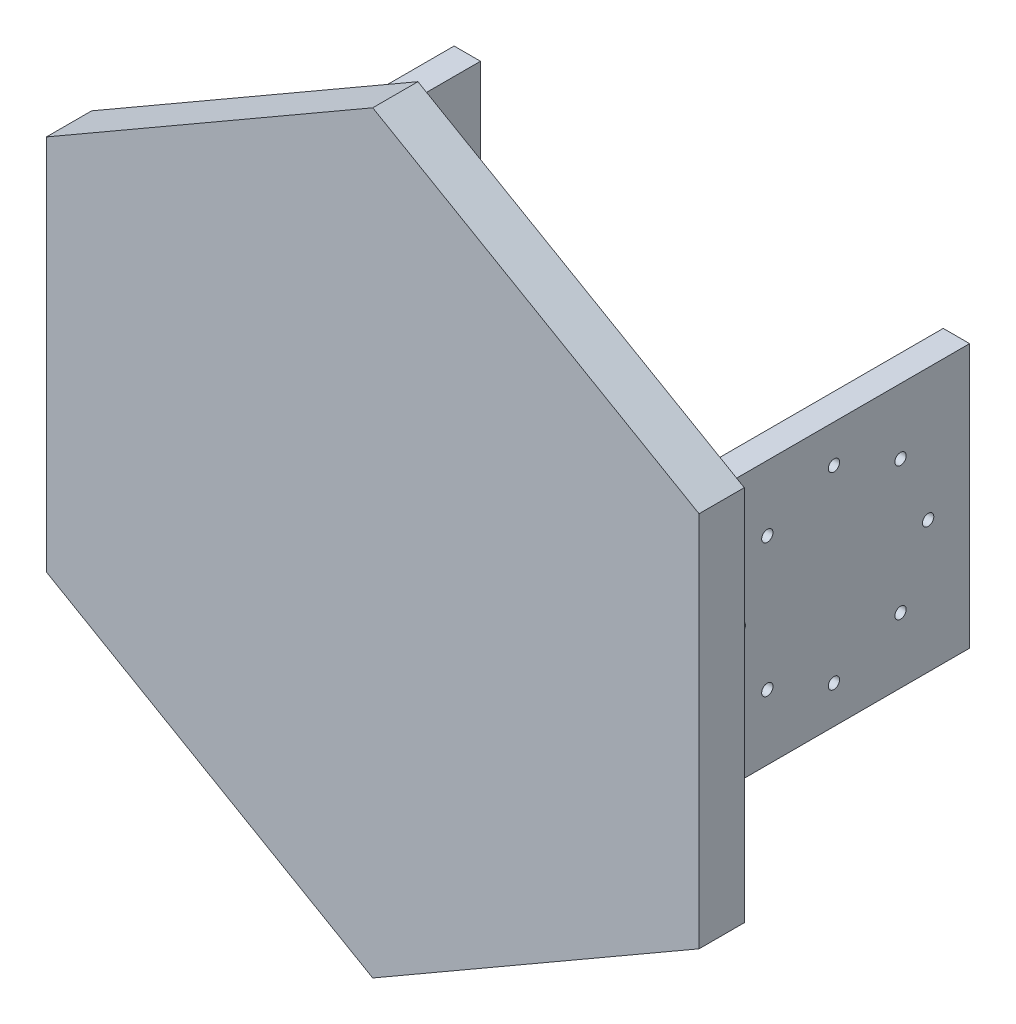
ISO-10303-21;
HEADER;
FILE_DESCRIPTION(('STEP AP214'),'2;1');
FILE_NAME('part.step','',(''),(''),'','','');
FILE_SCHEMA(('AUTOMOTIVE_DESIGN { 1 0 10303 214 1 1 1 1 }'));
ENDSEC;
DATA;
#1=APPLICATION_CONTEXT('core data for automotive mechanical design processes');
#2=APPLICATION_PROTOCOL_DEFINITION('international standard','automotive_design',2000,#1);
#3=PRODUCT_CONTEXT('',#1,'mechanical');
#4=PRODUCT('Part','Part','',(#3));
#5=PRODUCT_RELATED_PRODUCT_CATEGORY('part','',(#4));
#6=PRODUCT_DEFINITION_FORMATION('','',#4);
#7=PRODUCT_DEFINITION_CONTEXT('part definition',#1,'design');
#8=PRODUCT_DEFINITION('design','',#6,#7);
#9=PRODUCT_DEFINITION_SHAPE('','',#8);
#10=(LENGTH_UNIT() NAMED_UNIT(*) SI_UNIT(.MILLI.,.METRE.));
#11=(NAMED_UNIT(*) PLANE_ANGLE_UNIT() SI_UNIT($,.RADIAN.));
#12=(NAMED_UNIT(*) SI_UNIT($,.STERADIAN.) SOLID_ANGLE_UNIT());
#13=UNCERTAINTY_MEASURE_WITH_UNIT(LENGTH_MEASURE(1.E-05),#10,'distance_accuracy_value','');
#14=(GEOMETRIC_REPRESENTATION_CONTEXT(3) GLOBAL_UNCERTAINTY_ASSIGNED_CONTEXT((#13)) GLOBAL_UNIT_ASSIGNED_CONTEXT((#10,
#11,#12)) REPRESENTATION_CONTEXT('',''));
#15=CARTESIAN_POINT('',(0.,0.,0.));
#16=DIRECTION('',(0.,0.,1.));
#17=DIRECTION('',(1.,0.,0.));
#18=AXIS2_PLACEMENT_3D('',#15,#16,#17);
#19=CARTESIAN_POINT('',(25.7,17.5,-10.));
#20=DIRECTION('',(0.,1.,0.));
#21=DIRECTION('',(0.,0.,1.));
#22=AXIS2_PLACEMENT_3D('',#19,#20,#21);
#23=PLANE('',#22);
#24=DIRECTION('',(0.,0.,1.));
#25=VECTOR('',#24,1.);
#26=CARTESIAN_POINT('',(-34.2,17.5,-45.));
#27=LINE('',#26,#25);
#28=CARTESIAN_POINT('',(-34.2,17.5,-45.));
#29=VERTEX_POINT('',#28);
#30=CARTESIAN_POINT('',(-34.2,17.5,-6.));
#31=VERTEX_POINT('',#30);
#32=EDGE_CURVE('E341',#29,#31,#27,.T.);
#33=ORIENTED_EDGE('',*,*,#32,.T.);
#34=DIRECTION('',(1.,0.,0.));
#35=VECTOR('',#34,1.);
#36=CARTESIAN_POINT('',(25.7,17.5,-6.));
#37=LINE('',#36,#35);
#38=CARTESIAN_POINT('',(-28.7,17.5,-6.));
#39=VERTEX_POINT('',#38);
#40=EDGE_CURVE('E221',#31,#39,#37,.T.);
#41=ORIENTED_EDGE('',*,*,#40,.T.);
#42=CARTESIAN_POINT('',(-25.7,17.5,-10.));
#43=DIRECTION('',(0.,-1.,0.));
#44=DIRECTION('',(0.,0.,1.));
#45=AXIS2_PLACEMENT_3D('',#42,#43,#44);
#46=CIRCLE('',#45,5.);
#47=CARTESIAN_POINT('',(-30.7,17.5,-10.));
#48=VERTEX_POINT('',#47);
#49=EDGE_CURVE('E335',#39,#48,#46,.T.);
#50=ORIENTED_EDGE('',*,*,#49,.T.);
#51=DIRECTION('',(0.,0.,-1.));
#52=VECTOR('',#51,1.);
#53=CARTESIAN_POINT('',(-30.7,17.5,-45.));
#54=LINE('',#53,#52);
#55=CARTESIAN_POINT('',(-30.7,17.5,-45.));
#56=VERTEX_POINT('',#55);
#57=EDGE_CURVE('E337',#48,#56,#54,.T.);
#58=ORIENTED_EDGE('',*,*,#57,.T.);
#59=DIRECTION('',(-1.,0.,0.));
#60=VECTOR('',#59,1.);
#61=CARTESIAN_POINT('',(-30.7,17.5,-45.));
#62=LINE('',#61,#60);
#63=EDGE_CURVE('E339',#56,#29,#62,.T.);
#64=ORIENTED_EDGE('',*,*,#63,.T.);
#65=EDGE_LOOP('',(#33,#41,#50,#58,#64));
#66=FACE_BOUND('',#65,.T.);
#67=ADVANCED_FACE('F42',(#66),#23,.T.);
#68=CARTESIAN_POINT('',(25.7,17.5,-10.));
#69=DIRECTION('',(0.,-1.,0.));
#70=DIRECTION('',(0.,0.,1.));
#71=AXIS2_PLACEMENT_3D('',#68,#69,#70);
#72=CIRCLE('',#71,5.);
#73=CARTESIAN_POINT('',(30.7,17.5,-10.));
#74=VERTEX_POINT('',#73);
#75=CARTESIAN_POINT('',(28.7,17.5,-6.));
#76=VERTEX_POINT('',#75);
#77=EDGE_CURVE('E332',#74,#76,#72,.T.);
#78=ORIENTED_EDGE('',*,*,#77,.T.);
#79=CARTESIAN_POINT('',(34.2,17.5,-6.));
#80=VERTEX_POINT('',#79);
#81=EDGE_CURVE('E220',#76,#80,#37,.T.);
#82=ORIENTED_EDGE('',*,*,#81,.T.);
#83=DIRECTION('',(0.,0.,-1.));
#84=VECTOR('',#83,1.);
#85=CARTESIAN_POINT('',(34.2,17.5,-5.));
#86=LINE('',#85,#84);
#87=CARTESIAN_POINT('',(34.2,17.5,-45.));
#88=VERTEX_POINT('',#87);
#89=EDGE_CURVE('E344',#80,#88,#86,.T.);
#90=ORIENTED_EDGE('',*,*,#89,.T.);
#91=DIRECTION('',(-1.,0.,0.));
#92=VECTOR('',#91,1.);
#93=CARTESIAN_POINT('',(34.2,17.5,-45.));
#94=LINE('',#93,#92);
#95=CARTESIAN_POINT('',(30.7,17.5,-45.));
#96=VERTEX_POINT('',#95);
#97=EDGE_CURVE('E326',#88,#96,#94,.T.);
#98=ORIENTED_EDGE('',*,*,#97,.T.);
#99=DIRECTION('',(0.,0.,1.));
#100=VECTOR('',#99,1.);
#101=CARTESIAN_POINT('',(30.7,17.5,-10.));
#102=LINE('',#101,#100);
#103=EDGE_CURVE('E329',#96,#74,#102,.T.);
#104=ORIENTED_EDGE('',*,*,#103,.T.);
#105=EDGE_LOOP('',(#78,#82,#90,#98,#104));
#106=FACE_BOUND('',#105,.T.);
#107=ADVANCED_FACE('F388',(#106),#23,.T.);
#108=CARTESIAN_POINT('',(25.7,-17.5,-10.));
#109=DIRECTION('',(0.,1.,0.));
#110=DIRECTION('',(0.,0.,1.));
#111=AXIS2_PLACEMENT_3D('',#108,#109,#110);
#112=PLANE('',#111);
#113=DIRECTION('',(1.,0.,0.));
#114=VECTOR('',#113,1.);
#115=CARTESIAN_POINT('',(25.7,-17.5,-6.));
#116=LINE('',#115,#114);
#117=CARTESIAN_POINT('',(-34.2,-17.5,-6.));
#118=VERTEX_POINT('',#117);
#119=CARTESIAN_POINT('',(-28.7,-17.5,-6.));
#120=VERTEX_POINT('',#119);
#121=EDGE_CURVE('E209',#118,#120,#116,.T.);
#122=ORIENTED_EDGE('',*,*,#121,.F.);
#123=DIRECTION('',(0.,0.,1.));
#124=VECTOR('',#123,1.);
#125=CARTESIAN_POINT('',(-34.2,-17.5,-45.));
#126=LINE('',#125,#124);
#127=CARTESIAN_POINT('',(-34.2,-17.5,-45.));
#128=VERTEX_POINT('',#127);
#129=EDGE_CURVE('E360',#128,#118,#126,.T.);
#130=ORIENTED_EDGE('',*,*,#129,.F.);
#131=DIRECTION('',(-1.,0.,0.));
#132=VECTOR('',#131,1.);
#133=CARTESIAN_POINT('',(-30.7,-17.5,-45.));
#134=LINE('',#133,#132);
#135=CARTESIAN_POINT('',(-30.7,-17.5,-45.));
#136=VERTEX_POINT('',#135);
#137=EDGE_CURVE('E358',#136,#128,#134,.T.);
#138=ORIENTED_EDGE('',*,*,#137,.F.);
#139=DIRECTION('',(0.,0.,-1.));
#140=VECTOR('',#139,1.);
#141=CARTESIAN_POINT('',(-30.7,-17.5,-45.));
#142=LINE('',#141,#140);
#143=CARTESIAN_POINT('',(-30.7,-17.5,-10.));
#144=VERTEX_POINT('',#143);
#145=EDGE_CURVE('E356',#144,#136,#142,.T.);
#146=ORIENTED_EDGE('',*,*,#145,.F.);
#147=CARTESIAN_POINT('',(-25.7,-17.5,-10.));
#148=DIRECTION('',(0.,-1.,0.));
#149=DIRECTION('',(0.,0.,1.));
#150=AXIS2_PLACEMENT_3D('',#147,#148,#149);
#151=CIRCLE('',#150,5.);
#152=EDGE_CURVE('E354',#120,#144,#151,.T.);
#153=ORIENTED_EDGE('',*,*,#152,.F.);
#154=EDGE_LOOP('',(#122,#130,#138,#146,#153));
#155=FACE_BOUND('',#154,.T.);
#156=ADVANCED_FACE('F419',(#155),#112,.F.);
#157=CARTESIAN_POINT('',(28.7,-17.5,-6.));
#158=VERTEX_POINT('',#157);
#159=CARTESIAN_POINT('',(34.2,-17.5,-6.));
#160=VERTEX_POINT('',#159);
#161=EDGE_CURVE('E217',#158,#160,#116,.T.);
#162=ORIENTED_EDGE('',*,*,#161,.F.);
#163=CARTESIAN_POINT('',(25.7,-17.5,-10.));
#164=DIRECTION('',(0.,-1.,0.));
#165=DIRECTION('',(0.,0.,1.));
#166=AXIS2_PLACEMENT_3D('',#163,#164,#165);
#167=CIRCLE('',#166,5.);
#168=CARTESIAN_POINT('',(30.7,-17.5,-10.));
#169=VERTEX_POINT('',#168);
#170=EDGE_CURVE('E351',#169,#158,#167,.T.);
#171=ORIENTED_EDGE('',*,*,#170,.F.);
#172=DIRECTION('',(0.,0.,1.));
#173=VECTOR('',#172,1.);
#174=CARTESIAN_POINT('',(30.7,-17.5,-10.));
#175=LINE('',#174,#173);
#176=CARTESIAN_POINT('',(30.7,-17.5,-45.));
#177=VERTEX_POINT('',#176);
#178=EDGE_CURVE('E349',#177,#169,#175,.T.);
#179=ORIENTED_EDGE('',*,*,#178,.F.);
#180=DIRECTION('',(-1.,0.,0.));
#181=VECTOR('',#180,1.);
#182=CARTESIAN_POINT('',(34.2,-17.5,-45.));
#183=LINE('',#182,#181);
#184=CARTESIAN_POINT('',(34.2,-17.5,-45.));
#185=VERTEX_POINT('',#184);
#186=EDGE_CURVE('E325',#185,#177,#183,.T.);
#187=ORIENTED_EDGE('',*,*,#186,.F.);
#188=DIRECTION('',(0.,0.,-1.));
#189=VECTOR('',#188,1.);
#190=CARTESIAN_POINT('',(34.2,-17.5,-5.));
#191=LINE('',#190,#189);
#192=EDGE_CURVE('E330',#160,#185,#191,.T.);
#193=ORIENTED_EDGE('',*,*,#192,.F.);
#194=EDGE_LOOP('',(#162,#171,#179,#187,#193));
#195=FACE_BOUND('',#194,.T.);
#196=ADVANCED_FACE('F382',(#195),#112,.F.);
#197=CARTESIAN_POINT('',(34.2,17.5,-45.));
#198=DIRECTION('',(0.,0.,1.));
#199=DIRECTION('',(1.,0.,0.));
#200=AXIS2_PLACEMENT_3D('',#197,#198,#199);
#201=PLANE('',#200);
#202=ORIENTED_EDGE('',*,*,#186,.T.);
#203=DIRECTION('',(0.,-1.,0.));
#204=VECTOR('',#203,1.);
#205=CARTESIAN_POINT('',(30.7,17.5,-45.));
#206=LINE('',#205,#204);
#207=EDGE_CURVE('E12',#96,#177,#206,.T.);
#208=ORIENTED_EDGE('',*,*,#207,.F.);
#209=ORIENTED_EDGE('',*,*,#97,.F.);
#210=DIRECTION('',(0.,-1.,0.));
#211=VECTOR('',#210,1.);
#212=CARTESIAN_POINT('',(34.2,17.5,-45.));
#213=LINE('',#212,#211);
#214=EDGE_CURVE('E346',#88,#185,#213,.T.);
#215=ORIENTED_EDGE('',*,*,#214,.T.);
#216=EDGE_LOOP('',(#202,#208,#209,#215));
#217=FACE_BOUND('',#216,.T.);
#218=ADVANCED_FACE('F44',(#217),#201,.F.);
#219=CARTESIAN_POINT('',(30.7,17.5,-10.));
#220=DIRECTION('',(1.,0.,0.));
#221=DIRECTION('',(0.,0.,-1.));
#222=AXIS2_PLACEMENT_3D('',#219,#220,#221);
#223=PLANE('',#222);
#224=CARTESIAN_POINT('',(30.7,-12.5,-27.));
#225=DIRECTION('',(1.,0.,0.));
#226=DIRECTION('',(0.,0.,-1.));
#227=AXIS2_PLACEMENT_3D('',#224,#225,#226);
#228=CIRCLE('',#227,0.750000000000002);
#229=CARTESIAN_POINT('',(30.7,-12.5,-27.75));
#230=VERTEX_POINT('',#229);
#231=EDGE_CURVE('E238',#230,#230,#228,.T.);
#232=ORIENTED_EDGE('',*,*,#231,.T.);
#233=EDGE_LOOP('',(#232));
#234=FACE_BOUND('',#233,.T.);
#235=CARTESIAN_POINT('',(30.7,12.5,-27.));
#236=DIRECTION('',(1.,0.,0.));
#237=DIRECTION('',(0.,0.,-1.));
#238=AXIS2_PLACEMENT_3D('',#235,#236,#237);
#239=CIRCLE('',#238,0.749999999999998);
#240=CARTESIAN_POINT('',(30.7,12.5,-27.75));
#241=VERTEX_POINT('',#240);
#242=EDGE_CURVE('E310',#241,#241,#239,.T.);
#243=ORIENTED_EDGE('',*,*,#242,.T.);
#244=EDGE_LOOP('',(#243));
#245=FACE_BOUND('',#244,.T.);
#246=CARTESIAN_POINT('',(30.7,8.83883476483184,-35.8388347648318));
#247=DIRECTION('',(1.,0.,0.));
#248=DIRECTION('',(0.,0.,-1.));
#249=AXIS2_PLACEMENT_3D('',#246,#247,#248);
#250=CIRCLE('',#249,0.749999999999999);
#251=CARTESIAN_POINT('',(30.7,8.83883476483184,-36.5888347648318));
#252=VERTEX_POINT('',#251);
#253=EDGE_CURVE('E304',#252,#252,#250,.T.);
#254=ORIENTED_EDGE('',*,*,#253,.T.);
#255=EDGE_LOOP('',(#254));
#256=FACE_BOUND('',#255,.T.);
#257=CARTESIAN_POINT('',(30.7,0.,-39.5));
#258=DIRECTION('',(1.,0.,0.));
#259=DIRECTION('',(0.,0.,-1.));
#260=AXIS2_PLACEMENT_3D('',#257,#258,#259);
#261=CIRCLE('',#260,0.749999999999999);
#262=CARTESIAN_POINT('',(30.7,0.,-40.25));
#263=VERTEX_POINT('',#262);
#264=EDGE_CURVE('E298',#263,#263,#261,.T.);
#265=ORIENTED_EDGE('',*,*,#264,.T.);
#266=EDGE_LOOP('',(#265));
#267=FACE_BOUND('',#266,.T.);
#268=CARTESIAN_POINT('',(30.7,-8.83883476483184,-35.8388347648318));
#269=DIRECTION('',(1.,0.,0.));
#270=DIRECTION('',(0.,0.,-1.));
#271=AXIS2_PLACEMENT_3D('',#268,#269,#270);
#272=CIRCLE('',#271,0.749999999999999);
#273=CARTESIAN_POINT('',(30.7,-8.83883476483184,-36.5888347648318));
#274=VERTEX_POINT('',#273);
#275=EDGE_CURVE('E292',#274,#274,#272,.T.);
#276=ORIENTED_EDGE('',*,*,#275,.T.);
#277=EDGE_LOOP('',(#276));
#278=FACE_BOUND('',#277,.T.);
#279=CARTESIAN_POINT('',(30.7,-8.83883476483185,-18.1611652351682));
#280=DIRECTION('',(1.,0.,0.));
#281=DIRECTION('',(0.,0.,-1.));
#282=AXIS2_PLACEMENT_3D('',#279,#280,#281);
#283=CIRCLE('',#282,0.749999999999998);
#284=CARTESIAN_POINT('',(30.7,-8.83883476483185,-18.9111652351682));
#285=VERTEX_POINT('',#284);
#286=EDGE_CURVE('E286',#285,#285,#283,.T.);
#287=ORIENTED_EDGE('',*,*,#286,.T.);
#288=EDGE_LOOP('',(#287));
#289=FACE_BOUND('',#288,.T.);
#290=CARTESIAN_POINT('',(30.7,0.,-14.5));
#291=DIRECTION('',(1.,0.,0.));
#292=DIRECTION('',(0.,0.,-1.));
#293=AXIS2_PLACEMENT_3D('',#290,#291,#292);
#294=CIRCLE('',#293,0.750000000000002);
#295=CARTESIAN_POINT('',(30.7,0.,-15.25));
#296=VERTEX_POINT('',#295);
#297=EDGE_CURVE('E280',#296,#296,#294,.T.);
#298=ORIENTED_EDGE('',*,*,#297,.T.);
#299=EDGE_LOOP('',(#298));
#300=FACE_BOUND('',#299,.T.);
#301=CARTESIAN_POINT('',(30.7,8.83883476483184,-18.1611652351681));
#302=DIRECTION('',(1.,0.,0.));
#303=DIRECTION('',(0.,0.,-1.));
#304=AXIS2_PLACEMENT_3D('',#301,#302,#303);
#305=CIRCLE('',#304,0.750000000000005);
#306=CARTESIAN_POINT('',(30.7,8.83883476483184,-18.9111652351682));
#307=VERTEX_POINT('',#306);
#308=EDGE_CURVE('E322',#307,#307,#305,.T.);
#309=ORIENTED_EDGE('',*,*,#308,.T.);
#310=EDGE_LOOP('',(#309));
#311=FACE_BOUND('',#310,.T.);
#312=ORIENTED_EDGE('',*,*,#178,.T.);
#313=DIRECTION('',(0.,-1.,0.));
#314=VECTOR('',#313,1.);
#315=CARTESIAN_POINT('',(30.7,17.5,-10.));
#316=LINE('',#315,#314);
#317=EDGE_CURVE('E50',#74,#169,#316,.T.);
#318=ORIENTED_EDGE('',*,*,#317,.F.);
#319=ORIENTED_EDGE('',*,*,#103,.F.);
#320=ORIENTED_EDGE('',*,*,#207,.T.);
#321=EDGE_LOOP('',(#312,#318,#319,#320));
#322=FACE_BOUND('',#321,.T.);
#323=ADVANCED_FACE('F391',(#234,#245,#256,#267,#278,#289,#300,#311,#322),#223,.F.);
#324=CARTESIAN_POINT('',(25.7,17.5,-10.));
#325=DIRECTION('',(0.,-1.,0.));
#326=DIRECTION('',(0.,0.,-1.));
#327=AXIS2_PLACEMENT_3D('',#324,#325,#326);
#328=CYLINDRICAL_SURFACE('',#327,5.);
#329=ORIENTED_EDGE('',*,*,#170,.T.);
#330=DIRECTION('',(0.,-1.,0.));
#331=VECTOR('',#330,1.);
#332=CARTESIAN_POINT('',(28.7,17.5,-6.));
#333=LINE('',#332,#331);
#334=EDGE_CURVE('E227',#158,#76,#333,.F.);
#335=ORIENTED_EDGE('',*,*,#334,.T.);
#336=ORIENTED_EDGE('',*,*,#77,.F.);
#337=ORIENTED_EDGE('',*,*,#317,.T.);
#338=EDGE_LOOP('',(#329,#335,#336,#337));
#339=FACE_BOUND('',#338,.T.);
#340=ADVANCED_FACE('F379',(#339),#328,.F.);
#341=CARTESIAN_POINT('',(-25.7,17.5,-10.));
#342=DIRECTION('',(0.,-1.,0.));
#343=DIRECTION('',(0.,0.,-1.));
#344=AXIS2_PLACEMENT_3D('',#341,#342,#343);
#345=CYLINDRICAL_SURFACE('',#344,5.);
#346=ORIENTED_EDGE('',*,*,#49,.F.);
#347=DIRECTION('',(0.,-1.,0.));
#348=VECTOR('',#347,1.);
#349=CARTESIAN_POINT('',(-28.7,17.5,-6.));
#350=LINE('',#349,#348);
#351=EDGE_CURVE('E57',#39,#120,#350,.T.);
#352=ORIENTED_EDGE('',*,*,#351,.T.);
#353=ORIENTED_EDGE('',*,*,#152,.T.);
#354=DIRECTION('',(0.,-1.,0.));
#355=VECTOR('',#354,1.);
#356=CARTESIAN_POINT('',(-30.7,17.5,-10.));
#357=LINE('',#356,#355);
#358=EDGE_CURVE('E372',#48,#144,#357,.T.);
#359=ORIENTED_EDGE('',*,*,#358,.F.);
#360=EDGE_LOOP('',(#346,#352,#353,#359));
#361=FACE_BOUND('',#360,.T.);
#362=ADVANCED_FACE('F443',(#361),#345,.F.);
#363=CARTESIAN_POINT('',(-30.7,17.5,-45.));
#364=DIRECTION('',(-1.,0.,0.));
#365=DIRECTION('',(0.,0.,1.));
#366=AXIS2_PLACEMENT_3D('',#363,#364,#365);
#367=PLANE('',#366);
#368=CARTESIAN_POINT('',(-30.7,-12.5,-27.));
#369=DIRECTION('',(-1.,0.,0.));
#370=DIRECTION('',(0.,0.,1.));
#371=AXIS2_PLACEMENT_3D('',#368,#369,#370);
#372=CIRCLE('',#371,0.750000000000002);
#373=CARTESIAN_POINT('',(-30.7,-12.5,-26.25));
#374=VERTEX_POINT('',#373);
#375=EDGE_CURVE('E233',#374,#374,#372,.T.);
#376=ORIENTED_EDGE('',*,*,#375,.T.);
#377=EDGE_LOOP('',(#376));
#378=FACE_BOUND('',#377,.T.);
#379=CARTESIAN_POINT('',(-30.7,12.5,-27.));
#380=DIRECTION('',(-1.,0.,0.));
#381=DIRECTION('',(0.,0.,1.));
#382=AXIS2_PLACEMENT_3D('',#379,#380,#381);
#383=CIRCLE('',#382,0.749999999999998);
#384=CARTESIAN_POINT('',(-30.7,12.5,-26.25));
#385=VERTEX_POINT('',#384);
#386=EDGE_CURVE('E307',#385,#385,#383,.T.);
#387=ORIENTED_EDGE('',*,*,#386,.T.);
#388=EDGE_LOOP('',(#387));
#389=FACE_BOUND('',#388,.T.);
#390=CARTESIAN_POINT('',(-30.7,8.83883476483184,-35.8388347648318));
#391=DIRECTION('',(-1.,0.,0.));
#392=DIRECTION('',(0.,0.,1.));
#393=AXIS2_PLACEMENT_3D('',#390,#391,#392);
#394=CIRCLE('',#393,0.749999999999999);
#395=CARTESIAN_POINT('',(-30.7,8.83883476483184,-35.0888347648318));
#396=VERTEX_POINT('',#395);
#397=EDGE_CURVE('E301',#396,#396,#394,.T.);
#398=ORIENTED_EDGE('',*,*,#397,.T.);
#399=EDGE_LOOP('',(#398));
#400=FACE_BOUND('',#399,.T.);
#401=CARTESIAN_POINT('',(-30.7,0.,-39.5));
#402=DIRECTION('',(-1.,0.,0.));
#403=DIRECTION('',(0.,0.,1.));
#404=AXIS2_PLACEMENT_3D('',#401,#402,#403);
#405=CIRCLE('',#404,0.749999999999999);
#406=CARTESIAN_POINT('',(-30.7,0.,-38.75));
#407=VERTEX_POINT('',#406);
#408=EDGE_CURVE('E295',#407,#407,#405,.T.);
#409=ORIENTED_EDGE('',*,*,#408,.T.);
#410=EDGE_LOOP('',(#409));
#411=FACE_BOUND('',#410,.T.);
#412=CARTESIAN_POINT('',(-30.7,-8.83883476483184,-35.8388347648318));
#413=DIRECTION('',(-1.,0.,0.));
#414=DIRECTION('',(0.,0.,1.));
#415=AXIS2_PLACEMENT_3D('',#412,#413,#414);
#416=CIRCLE('',#415,0.749999999999999);
#417=CARTESIAN_POINT('',(-30.7,-8.83883476483184,-35.0888347648318));
#418=VERTEX_POINT('',#417);
#419=EDGE_CURVE('E289',#418,#418,#416,.T.);
#420=ORIENTED_EDGE('',*,*,#419,.T.);
#421=EDGE_LOOP('',(#420));
#422=FACE_BOUND('',#421,.T.);
#423=CARTESIAN_POINT('',(-30.7,-8.83883476483185,-18.1611652351682));
#424=DIRECTION('',(-1.,0.,0.));
#425=DIRECTION('',(0.,0.,1.));
#426=AXIS2_PLACEMENT_3D('',#423,#424,#425);
#427=CIRCLE('',#426,0.749999999999998);
#428=CARTESIAN_POINT('',(-30.7,-8.83883476483185,-17.4111652351682));
#429=VERTEX_POINT('',#428);
#430=EDGE_CURVE('E283',#429,#429,#427,.T.);
#431=ORIENTED_EDGE('',*,*,#430,.T.);
#432=EDGE_LOOP('',(#431));
#433=FACE_BOUND('',#432,.T.);
#434=CARTESIAN_POINT('',(-30.7,0.,-14.5));
#435=DIRECTION('',(-1.,0.,0.));
#436=DIRECTION('',(0.,0.,1.));
#437=AXIS2_PLACEMENT_3D('',#434,#435,#436);
#438=CIRCLE('',#437,0.750000000000002);
#439=CARTESIAN_POINT('',(-30.7,0.,-13.75));
#440=VERTEX_POINT('',#439);
#441=EDGE_CURVE('E267',#440,#440,#438,.T.);
#442=ORIENTED_EDGE('',*,*,#441,.T.);
#443=EDGE_LOOP('',(#442));
#444=FACE_BOUND('',#443,.T.);
#445=CARTESIAN_POINT('',(-30.7,8.83883476483184,-18.1611652351681));
#446=DIRECTION('',(-1.,0.,0.));
#447=DIRECTION('',(0.,0.,1.));
#448=AXIS2_PLACEMENT_3D('',#445,#446,#447);
#449=CIRCLE('',#448,0.750000000000005);
#450=CARTESIAN_POINT('',(-30.7,8.83883476483184,-17.4111652351681));
#451=VERTEX_POINT('',#450);
#452=EDGE_CURVE('E319',#451,#451,#449,.T.);
#453=ORIENTED_EDGE('',*,*,#452,.T.);
#454=EDGE_LOOP('',(#453));
#455=FACE_BOUND('',#454,.T.);
#456=ORIENTED_EDGE('',*,*,#145,.T.);
#457=DIRECTION('',(0.,-1.,0.));
#458=VECTOR('',#457,1.);
#459=CARTESIAN_POINT('',(-30.7,17.5,-45.));
#460=LINE('',#459,#458);
#461=EDGE_CURVE('E369',#56,#136,#460,.T.);
#462=ORIENTED_EDGE('',*,*,#461,.F.);
#463=ORIENTED_EDGE('',*,*,#57,.F.);
#464=ORIENTED_EDGE('',*,*,#358,.T.);
#465=EDGE_LOOP('',(#456,#462,#463,#464));
#466=FACE_BOUND('',#465,.T.);
#467=ADVANCED_FACE('F440',(#378,#389,#400,#411,#422,#433,#444,#455,#466),#367,.F.);
#468=CARTESIAN_POINT('',(-30.7,17.5,-45.));
#469=DIRECTION('',(0.,0.,1.));
#470=DIRECTION('',(1.,0.,0.));
#471=AXIS2_PLACEMENT_3D('',#468,#469,#470);
#472=PLANE('',#471);
#473=ORIENTED_EDGE('',*,*,#137,.T.);
#474=DIRECTION('',(0.,-1.,0.));
#475=VECTOR('',#474,1.);
#476=CARTESIAN_POINT('',(-34.2,17.5,-45.));
#477=LINE('',#476,#475);
#478=EDGE_CURVE('E366',#29,#128,#477,.T.);
#479=ORIENTED_EDGE('',*,*,#478,.F.);
#480=ORIENTED_EDGE('',*,*,#63,.F.);
#481=ORIENTED_EDGE('',*,*,#461,.T.);
#482=EDGE_LOOP('',(#473,#479,#480,#481));
#483=FACE_BOUND('',#482,.T.);
#484=ADVANCED_FACE('F407',(#483),#472,.F.);
#485=CARTESIAN_POINT('',(-34.2,17.5,-45.));
#486=DIRECTION('',(1.,0.,0.));
#487=DIRECTION('',(0.,0.,-1.));
#488=AXIS2_PLACEMENT_3D('',#485,#486,#487);
#489=PLANE('',#488);
#490=CARTESIAN_POINT('',(-34.2,-12.5,-27.));
#491=DIRECTION('',(-1.,0.,0.));
#492=DIRECTION('',(0.,0.,1.));
#493=AXIS2_PLACEMENT_3D('',#490,#491,#492);
#494=CIRCLE('',#493,0.750000000000002);
#495=CARTESIAN_POINT('',(-34.2,-12.5,-26.25));
#496=VERTEX_POINT('',#495);
#497=EDGE_CURVE('E229',#496,#496,#494,.T.);
#498=ORIENTED_EDGE('',*,*,#497,.F.);
#499=EDGE_LOOP('',(#498));
#500=FACE_BOUND('',#499,.T.);
#501=CARTESIAN_POINT('',(-34.2,12.5,-27.));
#502=DIRECTION('',(-1.,0.,0.));
#503=DIRECTION('',(0.,0.,1.));
#504=AXIS2_PLACEMENT_3D('',#501,#502,#503);
#505=CIRCLE('',#504,0.749999999999998);
#506=CARTESIAN_POINT('',(-34.2,12.5,-26.25));
#507=VERTEX_POINT('',#506);
#508=EDGE_CURVE('E253',#507,#507,#505,.T.);
#509=ORIENTED_EDGE('',*,*,#508,.F.);
#510=EDGE_LOOP('',(#509));
#511=FACE_BOUND('',#510,.T.);
#512=CARTESIAN_POINT('',(-34.2,8.83883476483184,-35.8388347648318));
#513=DIRECTION('',(-1.,0.,0.));
#514=DIRECTION('',(0.,0.,1.));
#515=AXIS2_PLACEMENT_3D('',#512,#513,#514);
#516=CIRCLE('',#515,0.749999999999999);
#517=CARTESIAN_POINT('',(-34.2,8.83883476483184,-35.0888347648318));
#518=VERTEX_POINT('',#517);
#519=EDGE_CURVE('E246',#518,#518,#516,.T.);
#520=ORIENTED_EDGE('',*,*,#519,.F.);
#521=EDGE_LOOP('',(#520));
#522=FACE_BOUND('',#521,.T.);
#523=CARTESIAN_POINT('',(-34.2,0.,-39.5));
#524=DIRECTION('',(-1.,0.,0.));
#525=DIRECTION('',(0.,0.,1.));
#526=AXIS2_PLACEMENT_3D('',#523,#524,#525);
#527=CIRCLE('',#526,0.749999999999999);
#528=CARTESIAN_POINT('',(-34.2,0.,-38.75));
#529=VERTEX_POINT('',#528);
#530=EDGE_CURVE('E245',#529,#529,#527,.T.);
#531=ORIENTED_EDGE('',*,*,#530,.F.);
#532=EDGE_LOOP('',(#531));
#533=FACE_BOUND('',#532,.T.);
#534=CARTESIAN_POINT('',(-34.2,-8.83883476483184,-35.8388347648318));
#535=DIRECTION('',(-1.,0.,0.));
#536=DIRECTION('',(0.,0.,1.));
#537=AXIS2_PLACEMENT_3D('',#534,#535,#536);
#538=CIRCLE('',#537,0.749999999999999);
#539=CARTESIAN_POINT('',(-34.2,-8.83883476483184,-35.0888347648318));
#540=VERTEX_POINT('',#539);
#541=EDGE_CURVE('E271',#540,#540,#538,.T.);
#542=ORIENTED_EDGE('',*,*,#541,.F.);
#543=EDGE_LOOP('',(#542));
#544=FACE_BOUND('',#543,.T.);
#545=CARTESIAN_POINT('',(-34.2,-8.83883476483185,-18.1611652351682));
#546=DIRECTION('',(-1.,0.,0.));
#547=DIRECTION('',(0.,0.,1.));
#548=AXIS2_PLACEMENT_3D('',#545,#546,#547);
#549=CIRCLE('',#548,0.749999999999998);
#550=CARTESIAN_POINT('',(-34.2,-8.83883476483185,-17.4111652351682));
#551=VERTEX_POINT('',#550);
#552=EDGE_CURVE('E264',#551,#551,#549,.T.);
#553=ORIENTED_EDGE('',*,*,#552,.F.);
#554=EDGE_LOOP('',(#553));
#555=FACE_BOUND('',#554,.T.);
#556=CARTESIAN_POINT('',(-34.2,0.,-14.5));
#557=DIRECTION('',(-1.,0.,0.));
#558=DIRECTION('',(0.,0.,1.));
#559=AXIS2_PLACEMENT_3D('',#556,#557,#558);
#560=CIRCLE('',#559,0.750000000000002);
#561=CARTESIAN_POINT('',(-34.2,0.,-13.75));
#562=VERTEX_POINT('',#561);
#563=EDGE_CURVE('E263',#562,#562,#560,.T.);
#564=ORIENTED_EDGE('',*,*,#563,.F.);
#565=EDGE_LOOP('',(#564));
#566=FACE_BOUND('',#565,.T.);
#567=CARTESIAN_POINT('',(-34.2,8.83883476483184,-18.1611652351681));
#568=DIRECTION('',(-1.,0.,0.));
#569=DIRECTION('',(0.,0.,1.));
#570=AXIS2_PLACEMENT_3D('',#567,#568,#569);
#571=CIRCLE('',#570,0.750000000000005);
#572=CARTESIAN_POINT('',(-34.2,8.83883476483184,-17.4111652351681));
#573=VERTEX_POINT('',#572);
#574=EDGE_CURVE('E313',#573,#573,#571,.T.);
#575=ORIENTED_EDGE('',*,*,#574,.F.);
#576=EDGE_LOOP('',(#575));
#577=FACE_BOUND('',#576,.T.);
#578=ORIENTED_EDGE('',*,*,#129,.T.);
#579=DIRECTION('',(0.,1.,0.));
#580=VECTOR('',#579,1.);
#581=CARTESIAN_POINT('',(-34.2,17.5,-6.00000000000001));
#582=LINE('',#581,#580);
#583=EDGE_CURVE('E224',#118,#31,#582,.T.);
#584=ORIENTED_EDGE('',*,*,#583,.T.);
#585=ORIENTED_EDGE('',*,*,#32,.F.);
#586=ORIENTED_EDGE('',*,*,#478,.T.);
#587=EDGE_LOOP('',(#578,#584,#585,#586));
#588=FACE_BOUND('',#587,.T.);
#589=ADVANCED_FACE('F397',(#500,#511,#522,#533,#544,#555,#566,#577,#588),#489,.F.);
#590=CARTESIAN_POINT('',(34.2,17.5,-5.));
#591=DIRECTION('',(-1.,0.,0.));
#592=DIRECTION('',(0.,0.,1.));
#593=AXIS2_PLACEMENT_3D('',#590,#591,#592);
#594=PLANE('',#593);
#595=CARTESIAN_POINT('',(34.2,-12.5,-27.));
#596=DIRECTION('',(-1.,0.,0.));
#597=DIRECTION('',(0.,0.,1.));
#598=AXIS2_PLACEMENT_3D('',#595,#596,#597);
#599=CIRCLE('',#598,0.750000000000002);
#600=CARTESIAN_POINT('',(34.2,-12.5,-26.25));
#601=VERTEX_POINT('',#600);
#602=EDGE_CURVE('E230',#601,#601,#599,.T.);
#603=ORIENTED_EDGE('',*,*,#602,.T.);
#604=EDGE_LOOP('',(#603));
#605=FACE_BOUND('',#604,.T.);
#606=CARTESIAN_POINT('',(34.2,12.5,-27.));
#607=DIRECTION('',(-1.,0.,0.));
#608=DIRECTION('',(0.,0.,1.));
#609=AXIS2_PLACEMENT_3D('',#606,#607,#608);
#610=CIRCLE('',#609,0.749999999999998);
#611=CARTESIAN_POINT('',(34.2,12.5,-26.25));
#612=VERTEX_POINT('',#611);
#613=EDGE_CURVE('E241',#612,#612,#610,.F.);
#614=ORIENTED_EDGE('',*,*,#613,.F.);
#615=EDGE_LOOP('',(#614));
#616=FACE_BOUND('',#615,.T.);
#617=CARTESIAN_POINT('',(34.2,8.83883476483184,-35.8388347648318));
#618=DIRECTION('',(-1.,0.,0.));
#619=DIRECTION('',(0.,0.,1.));
#620=AXIS2_PLACEMENT_3D('',#617,#618,#619);
#621=CIRCLE('',#620,0.749999999999999);
#622=CARTESIAN_POINT('',(34.2,8.83883476483184,-35.0888347648318));
#623=VERTEX_POINT('',#622);
#624=EDGE_CURVE('E250',#623,#623,#621,.F.);
#625=ORIENTED_EDGE('',*,*,#624,.F.);
#626=EDGE_LOOP('',(#625));
#627=FACE_BOUND('',#626,.T.);
#628=CARTESIAN_POINT('',(34.2,0.,-39.5));
#629=DIRECTION('',(-1.,0.,0.));
#630=DIRECTION('',(0.,0.,1.));
#631=AXIS2_PLACEMENT_3D('',#628,#629,#630);
#632=CIRCLE('',#631,0.749999999999999);
#633=CARTESIAN_POINT('',(34.2,0.,-38.75));
#634=VERTEX_POINT('',#633);
#635=EDGE_CURVE('E242',#634,#634,#632,.F.);
#636=ORIENTED_EDGE('',*,*,#635,.F.);
#637=EDGE_LOOP('',(#636));
#638=FACE_BOUND('',#637,.T.);
#639=CARTESIAN_POINT('',(34.2,-8.83883476483184,-35.8388347648318));
#640=DIRECTION('',(-1.,0.,0.));
#641=DIRECTION('',(0.,0.,1.));
#642=AXIS2_PLACEMENT_3D('',#639,#640,#641);
#643=CIRCLE('',#642,0.749999999999999);
#644=CARTESIAN_POINT('',(34.2,-8.83883476483184,-35.0888347648318));
#645=VERTEX_POINT('',#644);
#646=EDGE_CURVE('E249',#645,#645,#643,.F.);
#647=ORIENTED_EDGE('',*,*,#646,.F.);
#648=EDGE_LOOP('',(#647));
#649=FACE_BOUND('',#648,.T.);
#650=CARTESIAN_POINT('',(34.2,-8.83883476483185,-18.1611652351682));
#651=DIRECTION('',(-1.,0.,0.));
#652=DIRECTION('',(0.,0.,1.));
#653=AXIS2_PLACEMENT_3D('',#650,#651,#652);
#654=CIRCLE('',#653,0.749999999999998);
#655=CARTESIAN_POINT('',(34.2,-8.83883476483185,-17.4111652351682));
#656=VERTEX_POINT('',#655);
#657=EDGE_CURVE('E268',#656,#656,#654,.F.);
#658=ORIENTED_EDGE('',*,*,#657,.F.);
#659=EDGE_LOOP('',(#658));
#660=FACE_BOUND('',#659,.T.);
#661=CARTESIAN_POINT('',(34.2,0.,-14.5));
#662=DIRECTION('',(-1.,0.,0.));
#663=DIRECTION('',(0.,0.,1.));
#664=AXIS2_PLACEMENT_3D('',#661,#662,#663);
#665=CIRCLE('',#664,0.750000000000002);
#666=CARTESIAN_POINT('',(34.2,0.,-13.75));
#667=VERTEX_POINT('',#666);
#668=EDGE_CURVE('E260',#667,#667,#665,.F.);
#669=ORIENTED_EDGE('',*,*,#668,.F.);
#670=EDGE_LOOP('',(#669));
#671=FACE_BOUND('',#670,.T.);
#672=CARTESIAN_POINT('',(34.2,8.83883476483184,-18.1611652351681));
#673=DIRECTION('',(-1.,0.,0.));
#674=DIRECTION('',(0.,0.,1.));
#675=AXIS2_PLACEMENT_3D('',#672,#673,#674);
#676=CIRCLE('',#675,0.750000000000005);
#677=CARTESIAN_POINT('',(34.2,8.83883476483184,-17.4111652351681));
#678=VERTEX_POINT('',#677);
#679=EDGE_CURVE('E316',#678,#678,#676,.F.);
#680=ORIENTED_EDGE('',*,*,#679,.F.);
#681=EDGE_LOOP('',(#680));
#682=FACE_BOUND('',#681,.T.);
#683=ORIENTED_EDGE('',*,*,#89,.F.);
#684=DIRECTION('',(0.,-1.,0.));
#685=VECTOR('',#684,1.);
#686=CARTESIAN_POINT('',(34.2,17.5,-6.));
#687=LINE('',#686,#685);
#688=EDGE_CURVE('E65',#80,#160,#687,.T.);
#689=ORIENTED_EDGE('',*,*,#688,.T.);
#690=ORIENTED_EDGE('',*,*,#192,.T.);
#691=ORIENTED_EDGE('',*,*,#214,.F.);
#692=EDGE_LOOP('',(#683,#689,#690,#691));
#693=FACE_BOUND('',#692,.T.);
#694=ADVANCED_FACE('F394',(#605,#616,#627,#638,#649,#660,#671,#682,#693),#594,.F.);
#695=CARTESIAN_POINT('',(36.3213203435597,8.83883476483184,-18.1611652351681));
#696=DIRECTION('',(-1.,0.,0.));
#697=DIRECTION('',(0.,0.,1.));
#698=AXIS2_PLACEMENT_3D('',#695,#696,#697);
#699=CYLINDRICAL_SURFACE('',#698,0.750000000000005);
#700=ORIENTED_EDGE('',*,*,#679,.T.);
#701=EDGE_LOOP('',(#700));
#702=FACE_BOUND('',#701,.T.);
#703=ORIENTED_EDGE('',*,*,#308,.F.);
#704=EDGE_LOOP('',(#703));
#705=FACE_BOUND('',#704,.T.);
#706=ADVANCED_FACE('F396',(#702,#705),#699,.F.);
#707=ORIENTED_EDGE('',*,*,#574,.T.);
#708=EDGE_LOOP('',(#707));
#709=FACE_BOUND('',#708,.T.);
#710=ORIENTED_EDGE('',*,*,#452,.F.);
#711=EDGE_LOOP('',(#710));
#712=FACE_BOUND('',#711,.T.);
#713=ADVANCED_FACE('F404',(#709,#712),#699,.F.);
#714=CARTESIAN_POINT('',(36.3213203435597,0.,-14.5));
#715=DIRECTION('',(-1.,0.,0.));
#716=DIRECTION('',(0.,0.,1.));
#717=AXIS2_PLACEMENT_3D('',#714,#715,#716);
#718=CYLINDRICAL_SURFACE('',#717,0.750000000000002);
#719=ORIENTED_EDGE('',*,*,#668,.T.);
#720=EDGE_LOOP('',(#719));
#721=FACE_BOUND('',#720,.T.);
#722=ORIENTED_EDGE('',*,*,#297,.F.);
#723=EDGE_LOOP('',(#722));
#724=FACE_BOUND('',#723,.T.);
#725=ADVANCED_FACE('F476',(#721,#724),#718,.F.);
#726=CARTESIAN_POINT('',(36.3213203435597,-8.83883476483185,-18.1611652351682));
#727=DIRECTION('',(-1.,0.,0.));
#728=DIRECTION('',(0.,0.,1.));
#729=AXIS2_PLACEMENT_3D('',#726,#727,#728);
#730=CYLINDRICAL_SURFACE('',#729,0.749999999999998);
#731=ORIENTED_EDGE('',*,*,#657,.T.);
#732=EDGE_LOOP('',(#731));
#733=FACE_BOUND('',#732,.T.);
#734=ORIENTED_EDGE('',*,*,#286,.F.);
#735=EDGE_LOOP('',(#734));
#736=FACE_BOUND('',#735,.T.);
#737=ADVANCED_FACE('F478',(#733,#736),#730,.F.);
#738=CARTESIAN_POINT('',(36.3213203435597,-8.83883476483184,-35.8388347648318));
#739=DIRECTION('',(-1.,0.,0.));
#740=DIRECTION('',(0.,0.,1.));
#741=AXIS2_PLACEMENT_3D('',#738,#739,#740);
#742=CYLINDRICAL_SURFACE('',#741,0.749999999999999);
#743=ORIENTED_EDGE('',*,*,#646,.T.);
#744=EDGE_LOOP('',(#743));
#745=FACE_BOUND('',#744,.T.);
#746=ORIENTED_EDGE('',*,*,#275,.F.);
#747=EDGE_LOOP('',(#746));
#748=FACE_BOUND('',#747,.T.);
#749=ADVANCED_FACE('F486',(#745,#748),#742,.F.);
#750=CARTESIAN_POINT('',(36.3213203435597,0.,-39.5));
#751=DIRECTION('',(-1.,0.,0.));
#752=DIRECTION('',(0.,0.,1.));
#753=AXIS2_PLACEMENT_3D('',#750,#751,#752);
#754=CYLINDRICAL_SURFACE('',#753,0.749999999999999);
#755=ORIENTED_EDGE('',*,*,#635,.T.);
#756=EDGE_LOOP('',(#755));
#757=FACE_BOUND('',#756,.T.);
#758=ORIENTED_EDGE('',*,*,#264,.F.);
#759=EDGE_LOOP('',(#758));
#760=FACE_BOUND('',#759,.T.);
#761=ADVANCED_FACE('F517',(#757,#760),#754,.F.);
#762=CARTESIAN_POINT('',(36.3213203435597,8.83883476483184,-35.8388347648318));
#763=DIRECTION('',(-1.,0.,0.));
#764=DIRECTION('',(0.,0.,1.));
#765=AXIS2_PLACEMENT_3D('',#762,#763,#764);
#766=CYLINDRICAL_SURFACE('',#765,0.749999999999999);
#767=ORIENTED_EDGE('',*,*,#624,.T.);
#768=EDGE_LOOP('',(#767));
#769=FACE_BOUND('',#768,.T.);
#770=ORIENTED_EDGE('',*,*,#253,.F.);
#771=EDGE_LOOP('',(#770));
#772=FACE_BOUND('',#771,.T.);
#773=ADVANCED_FACE('F501',(#769,#772),#766,.F.);
#774=CARTESIAN_POINT('',(36.3213203435597,12.5,-27.));
#775=DIRECTION('',(-1.,0.,0.));
#776=DIRECTION('',(0.,0.,1.));
#777=AXIS2_PLACEMENT_3D('',#774,#775,#776);
#778=CYLINDRICAL_SURFACE('',#777,0.749999999999998);
#779=ORIENTED_EDGE('',*,*,#613,.T.);
#780=EDGE_LOOP('',(#779));
#781=FACE_BOUND('',#780,.T.);
#782=ORIENTED_EDGE('',*,*,#242,.F.);
#783=EDGE_LOOP('',(#782));
#784=FACE_BOUND('',#783,.T.);
#785=ADVANCED_FACE('F493',(#781,#784),#778,.F.);
#786=ORIENTED_EDGE('',*,*,#563,.T.);
#787=EDGE_LOOP('',(#786));
#788=FACE_BOUND('',#787,.T.);
#789=ORIENTED_EDGE('',*,*,#441,.F.);
#790=EDGE_LOOP('',(#789));
#791=FACE_BOUND('',#790,.T.);
#792=ADVANCED_FACE('F481',(#788,#791),#718,.F.);
#793=ORIENTED_EDGE('',*,*,#552,.T.);
#794=EDGE_LOOP('',(#793));
#795=FACE_BOUND('',#794,.T.);
#796=ORIENTED_EDGE('',*,*,#430,.F.);
#797=EDGE_LOOP('',(#796));
#798=FACE_BOUND('',#797,.T.);
#799=ADVANCED_FACE('F489',(#795,#798),#730,.F.);
#800=ORIENTED_EDGE('',*,*,#541,.T.);
#801=EDGE_LOOP('',(#800));
#802=FACE_BOUND('',#801,.T.);
#803=ORIENTED_EDGE('',*,*,#419,.F.);
#804=EDGE_LOOP('',(#803));
#805=FACE_BOUND('',#804,.T.);
#806=ADVANCED_FACE('F499',(#802,#805),#742,.F.);
#807=ORIENTED_EDGE('',*,*,#530,.T.);
#808=EDGE_LOOP('',(#807));
#809=FACE_BOUND('',#808,.T.);
#810=ORIENTED_EDGE('',*,*,#408,.F.);
#811=EDGE_LOOP('',(#810));
#812=FACE_BOUND('',#811,.T.);
#813=ADVANCED_FACE('F532',(#809,#812),#754,.F.);
#814=ORIENTED_EDGE('',*,*,#519,.T.);
#815=EDGE_LOOP('',(#814));
#816=FACE_BOUND('',#815,.T.);
#817=ORIENTED_EDGE('',*,*,#397,.F.);
#818=EDGE_LOOP('',(#817));
#819=FACE_BOUND('',#818,.T.);
#820=ADVANCED_FACE('F520',(#816,#819),#766,.F.);
#821=ORIENTED_EDGE('',*,*,#508,.T.);
#822=EDGE_LOOP('',(#821));
#823=FACE_BOUND('',#822,.T.);
#824=ORIENTED_EDGE('',*,*,#386,.F.);
#825=EDGE_LOOP('',(#824));
#826=FACE_BOUND('',#825,.T.);
#827=ADVANCED_FACE('F503',(#823,#826),#778,.F.);
#828=CARTESIAN_POINT('',(34.2,-12.5,-27.));
#829=DIRECTION('',(-1.,0.,0.));
#830=DIRECTION('',(0.,0.,1.));
#831=AXIS2_PLACEMENT_3D('',#828,#829,#830);
#832=CYLINDRICAL_SURFACE('',#831,0.750000000000002);
#833=ORIENTED_EDGE('',*,*,#602,.F.);
#834=EDGE_LOOP('',(#833));
#835=FACE_BOUND('',#834,.T.);
#836=ORIENTED_EDGE('',*,*,#231,.F.);
#837=EDGE_LOOP('',(#836));
#838=FACE_BOUND('',#837,.T.);
#839=ADVANCED_FACE('F523',(#835,#838),#832,.F.);
#840=ORIENTED_EDGE('',*,*,#497,.T.);
#841=EDGE_LOOP('',(#840));
#842=FACE_BOUND('',#841,.T.);
#843=ORIENTED_EDGE('',*,*,#375,.F.);
#844=EDGE_LOOP('',(#843));
#845=FACE_BOUND('',#844,.T.);
#846=ADVANCED_FACE('F529',(#842,#845),#832,.F.);
#847=CARTESIAN_POINT('',(0.,0.,-6.));
#848=DIRECTION('',(0.,0.,-1.));
#849=DIRECTION('',(-1.,0.,0.));
#850=AXIS2_PLACEMENT_3D('',#847,#848,#849);
#851=PLANE('',#850);
#852=ORIENTED_EDGE('',*,*,#351,.F.);
#853=ORIENTED_EDGE('',*,*,#40,.F.);
#854=ORIENTED_EDGE('',*,*,#583,.F.);
#855=ORIENTED_EDGE('',*,*,#121,.T.);
#856=EDGE_LOOP('',(#852,#853,#854,#855));
#857=FACE_BOUND('',#856,.T.);
#858=ORIENTED_EDGE('',*,*,#688,.F.);
#859=ORIENTED_EDGE('',*,*,#81,.F.);
#860=ORIENTED_EDGE('',*,*,#334,.F.);
#861=ORIENTED_EDGE('',*,*,#161,.T.);
#862=EDGE_LOOP('',(#858,#859,#860,#861));
#863=FACE_BOUND('',#862,.T.);
#864=DIRECTION('',(0.,1.,0.));
#865=VECTOR('',#864,1.);
#866=CARTESIAN_POINT('',(43.3012701892219,-25.,-6.));
#867=LINE('',#866,#865);
#868=CARTESIAN_POINT('',(43.3012701892219,-25.,-6.));
#869=VERTEX_POINT('',#868);
#870=CARTESIAN_POINT('',(43.3012701892219,25.,-6.));
#871=VERTEX_POINT('',#870);
#872=EDGE_CURVE('E175',#869,#871,#867,.T.);
#873=ORIENTED_EDGE('',*,*,#872,.F.);
#874=DIRECTION('',(0.866025403784438,0.5,0.));
#875=VECTOR('',#874,1.);
#876=CARTESIAN_POINT('',(0.,-50.,-6.));
#877=LINE('',#876,#875);
#878=CARTESIAN_POINT('',(0.,-50.,-6.));
#879=VERTEX_POINT('',#878);
#880=EDGE_CURVE('E168',#879,#869,#877,.T.);
#881=ORIENTED_EDGE('',*,*,#880,.F.);
#882=DIRECTION('',(0.866025403784438,-0.5,0.));
#883=VECTOR('',#882,1.);
#884=CARTESIAN_POINT('',(-43.3012701892219,-25.,-6.));
#885=LINE('',#884,#883);
#886=CARTESIAN_POINT('',(-43.3012701892219,-25.,-6.));
#887=VERTEX_POINT('',#886);
#888=EDGE_CURVE('E193',#887,#879,#885,.T.);
#889=ORIENTED_EDGE('',*,*,#888,.F.);
#890=DIRECTION('',(0.,-1.,0.));
#891=VECTOR('',#890,1.);
#892=CARTESIAN_POINT('',(-43.3012701892219,25.,-6.));
#893=LINE('',#892,#891);
#894=CARTESIAN_POINT('',(-43.3012701892219,25.,-6.));
#895=VERTEX_POINT('',#894);
#896=EDGE_CURVE('E190',#895,#887,#893,.T.);
#897=ORIENTED_EDGE('',*,*,#896,.F.);
#898=DIRECTION('',(-0.866025403784439,-0.5,0.));
#899=VECTOR('',#898,1.);
#900=CARTESIAN_POINT('',(0.,50.,-6.));
#901=LINE('',#900,#899);
#902=CARTESIAN_POINT('',(0.,50.,-6.));
#903=VERTEX_POINT('',#902);
#904=EDGE_CURVE('E179',#903,#895,#901,.T.);
#905=ORIENTED_EDGE('',*,*,#904,.F.);
#906=DIRECTION('',(-0.866025403784439,0.5,0.));
#907=VECTOR('',#906,1.);
#908=CARTESIAN_POINT('',(43.3012701892219,25.,-6.));
#909=LINE('',#908,#907);
#910=EDGE_CURVE('E160',#871,#903,#909,.T.);
#911=ORIENTED_EDGE('',*,*,#910,.F.);
#912=EDGE_LOOP('',(#873,#881,#889,#897,#905,#911));
#913=FACE_BOUND('',#912,.T.);
#914=ADVANCED_FACE('F173',(#857,#863,#913),#851,.T.);
#915=CARTESIAN_POINT('',(43.3012701892219,-25.,-6.));
#916=DIRECTION('',(1.,0.,0.));
#917=DIRECTION('',(0.,0.,-1.));
#918=AXIS2_PLACEMENT_3D('',#915,#916,#917);
#919=PLANE('',#918);
#920=DIRECTION('',(0.,1.,0.));
#921=VECTOR('',#920,1.);
#922=CARTESIAN_POINT('',(43.3012701892219,-25.,0.));
#923=LINE('',#922,#921);
#924=CARTESIAN_POINT('',(43.3012701892219,-25.,0.));
#925=VERTEX_POINT('',#924);
#926=CARTESIAN_POINT('',(43.3012701892219,25.,0.));
#927=VERTEX_POINT('',#926);
#928=EDGE_CURVE('E197',#925,#927,#923,.T.);
#929=ORIENTED_EDGE('',*,*,#928,.F.);
#930=DIRECTION('',(0.,0.,1.));
#931=VECTOR('',#930,1.);
#932=CARTESIAN_POINT('',(43.3012701892219,-25.,-6.));
#933=LINE('',#932,#931);
#934=EDGE_CURVE('E182',#869,#925,#933,.T.);
#935=ORIENTED_EDGE('',*,*,#934,.F.);
#936=ORIENTED_EDGE('',*,*,#872,.T.);
#937=DIRECTION('',(0.,0.,1.));
#938=VECTOR('',#937,1.);
#939=CARTESIAN_POINT('',(43.3012701892219,25.,-6.));
#940=LINE('',#939,#938);
#941=EDGE_CURVE('E157',#871,#927,#940,.T.);
#942=ORIENTED_EDGE('',*,*,#941,.T.);
#943=EDGE_LOOP('',(#929,#935,#936,#942));
#944=FACE_BOUND('',#943,.T.);
#945=ADVANCED_FACE('F181',(#944),#919,.T.);
#946=CARTESIAN_POINT('',(0.,-50.,-6.));
#947=DIRECTION('',(0.5,-0.866025403784439,0.));
#948=DIRECTION('',(0.866025403784439,0.5,0.));
#949=AXIS2_PLACEMENT_3D('',#946,#947,#948);
#950=PLANE('',#949);
#951=DIRECTION('',(0.866025403784438,0.5,0.));
#952=VECTOR('',#951,1.);
#953=CARTESIAN_POINT('',(0.,-50.,0.));
#954=LINE('',#953,#952);
#955=CARTESIAN_POINT('',(0.,-50.,0.));
#956=VERTEX_POINT('',#955);
#957=EDGE_CURVE('E183',#956,#925,#954,.T.);
#958=ORIENTED_EDGE('',*,*,#957,.F.);
#959=DIRECTION('',(0.,0.,1.));
#960=VECTOR('',#959,1.);
#961=CARTESIAN_POINT('',(0.,-50.,-6.));
#962=LINE('',#961,#960);
#963=EDGE_CURVE('E210',#879,#956,#962,.T.);
#964=ORIENTED_EDGE('',*,*,#963,.F.);
#965=ORIENTED_EDGE('',*,*,#880,.T.);
#966=ORIENTED_EDGE('',*,*,#934,.T.);
#967=EDGE_LOOP('',(#958,#964,#965,#966));
#968=FACE_BOUND('',#967,.T.);
#969=ADVANCED_FACE('F579',(#968),#950,.T.);
#970=CARTESIAN_POINT('',(-43.3012701892219,-25.,-6.));
#971=DIRECTION('',(-0.5,-0.866025403784439,0.));
#972=DIRECTION('',(0.866025403784439,-0.5,0.));
#973=AXIS2_PLACEMENT_3D('',#970,#971,#972);
#974=PLANE('',#973);
#975=DIRECTION('',(0.866025403784438,-0.5,0.));
#976=VECTOR('',#975,1.);
#977=CARTESIAN_POINT('',(-43.3012701892219,-25.,0.));
#978=LINE('',#977,#976);
#979=CARTESIAN_POINT('',(-43.3012701892219,-25.,0.));
#980=VERTEX_POINT('',#979);
#981=EDGE_CURVE('E186',#980,#956,#978,.T.);
#982=ORIENTED_EDGE('',*,*,#981,.F.);
#983=DIRECTION('',(0.,0.,1.));
#984=VECTOR('',#983,1.);
#985=CARTESIAN_POINT('',(-43.3012701892219,-25.,-6.));
#986=LINE('',#985,#984);
#987=EDGE_CURVE('E212',#887,#980,#986,.T.);
#988=ORIENTED_EDGE('',*,*,#987,.F.);
#989=ORIENTED_EDGE('',*,*,#888,.T.);
#990=ORIENTED_EDGE('',*,*,#963,.T.);
#991=EDGE_LOOP('',(#982,#988,#989,#990));
#992=FACE_BOUND('',#991,.T.);
#993=ADVANCED_FACE('F590',(#992),#974,.T.);
#994=CARTESIAN_POINT('',(-43.3012701892219,25.,-6.));
#995=DIRECTION('',(-1.,0.,0.));
#996=DIRECTION('',(0.,0.,1.));
#997=AXIS2_PLACEMENT_3D('',#994,#995,#996);
#998=PLANE('',#997);
#999=DIRECTION('',(0.,-1.,0.));
#1000=VECTOR('',#999,1.);
#1001=CARTESIAN_POINT('',(-43.3012701892219,25.,0.));
#1002=LINE('',#1001,#1000);
#1003=CARTESIAN_POINT('',(-43.3012701892219,25.,0.));
#1004=VERTEX_POINT('',#1003);
#1005=EDGE_CURVE('E203',#1004,#980,#1002,.T.);
#1006=ORIENTED_EDGE('',*,*,#1005,.F.);
#1007=DIRECTION('',(0.,0.,1.));
#1008=VECTOR('',#1007,1.);
#1009=CARTESIAN_POINT('',(-43.3012701892219,25.,-6.));
#1010=LINE('',#1009,#1008);
#1011=EDGE_CURVE('E214',#895,#1004,#1010,.T.);
#1012=ORIENTED_EDGE('',*,*,#1011,.F.);
#1013=ORIENTED_EDGE('',*,*,#896,.T.);
#1014=ORIENTED_EDGE('',*,*,#987,.T.);
#1015=EDGE_LOOP('',(#1006,#1012,#1013,#1014));
#1016=FACE_BOUND('',#1015,.T.);
#1017=ADVANCED_FACE('F586',(#1016),#998,.T.);
#1018=CARTESIAN_POINT('',(0.,50.,-6.));
#1019=DIRECTION('',(-0.5,0.866025403784439,0.));
#1020=DIRECTION('',(-0.866025403784439,-0.5,0.));
#1021=AXIS2_PLACEMENT_3D('',#1018,#1019,#1020);
#1022=PLANE('',#1021);
#1023=DIRECTION('',(-0.866025403784439,-0.5,0.));
#1024=VECTOR('',#1023,1.);
#1025=CARTESIAN_POINT('',(0.,50.,0.));
#1026=LINE('',#1025,#1024);
#1027=CARTESIAN_POINT('',(0.,50.,0.));
#1028=VERTEX_POINT('',#1027);
#1029=EDGE_CURVE('E200',#1028,#1004,#1026,.T.);
#1030=ORIENTED_EDGE('',*,*,#1029,.F.);
#1031=DIRECTION('',(0.,0.,1.));
#1032=VECTOR('',#1031,1.);
#1033=CARTESIAN_POINT('',(0.,50.,-6.));
#1034=LINE('',#1033,#1032);
#1035=EDGE_CURVE('E167',#903,#1028,#1034,.T.);
#1036=ORIENTED_EDGE('',*,*,#1035,.F.);
#1037=ORIENTED_EDGE('',*,*,#904,.T.);
#1038=ORIENTED_EDGE('',*,*,#1011,.T.);
#1039=EDGE_LOOP('',(#1030,#1036,#1037,#1038));
#1040=FACE_BOUND('',#1039,.T.);
#1041=ADVANCED_FACE('F583',(#1040),#1022,.T.);
#1042=CARTESIAN_POINT('',(43.3012701892219,25.,-6.));
#1043=DIRECTION('',(0.5,0.866025403784439,0.));
#1044=DIRECTION('',(-0.866025403784439,0.5,0.));
#1045=AXIS2_PLACEMENT_3D('',#1042,#1043,#1044);
#1046=PLANE('',#1045);
#1047=DIRECTION('',(-0.866025403784439,0.5,0.));
#1048=VECTOR('',#1047,1.);
#1049=CARTESIAN_POINT('',(43.3012701892219,25.,0.));
#1050=LINE('',#1049,#1048);
#1051=EDGE_CURVE('E162',#927,#1028,#1050,.T.);
#1052=ORIENTED_EDGE('',*,*,#1051,.F.);
#1053=ORIENTED_EDGE('',*,*,#941,.F.);
#1054=ORIENTED_EDGE('',*,*,#910,.T.);
#1055=ORIENTED_EDGE('',*,*,#1035,.T.);
#1056=EDGE_LOOP('',(#1052,#1053,#1054,#1055));
#1057=FACE_BOUND('',#1056,.T.);
#1058=ADVANCED_FACE('F159',(#1057),#1046,.T.);
#1059=CARTESIAN_POINT('',(-29.2,17.5,0.));
#1060=DIRECTION('',(0.,0.,-1.));
#1061=DIRECTION('',(-1.,0.,0.));
#1062=AXIS2_PLACEMENT_3D('',#1059,#1060,#1061);
#1063=PLANE('',#1062);
#1064=ORIENTED_EDGE('',*,*,#928,.T.);
#1065=ORIENTED_EDGE('',*,*,#1051,.T.);
#1066=ORIENTED_EDGE('',*,*,#1029,.T.);
#1067=ORIENTED_EDGE('',*,*,#1005,.T.);
#1068=ORIENTED_EDGE('',*,*,#981,.T.);
#1069=ORIENTED_EDGE('',*,*,#957,.T.);
#1070=EDGE_LOOP('',(#1064,#1065,#1066,#1067,#1068,#1069));
#1071=FACE_BOUND('',#1070,.T.);
#1072=ADVANCED_FACE('F582',(#1071),#1063,.F.);
#1073=CLOSED_SHELL('',(#67,#107,#156,#196,#218,#323,#340,#362,#467,#484,#589,#694,#706,#713,
#725,#737,#749,#761,#773,#785,#792,#799,#806,#813,#820,#827,#839,#846,#914,#945,#969,#993,#1017,
#1041,#1058,#1072));
#1074=MANIFOLD_SOLID_BREP('B2',#1073);
#1075=ADVANCED_BREP_SHAPE_REPRESENTATION('',(#18,#1074),#14);
#1076=SHAPE_DEFINITION_REPRESENTATION(#9,#1075);
ENDSEC;
END-ISO-10303-21;
